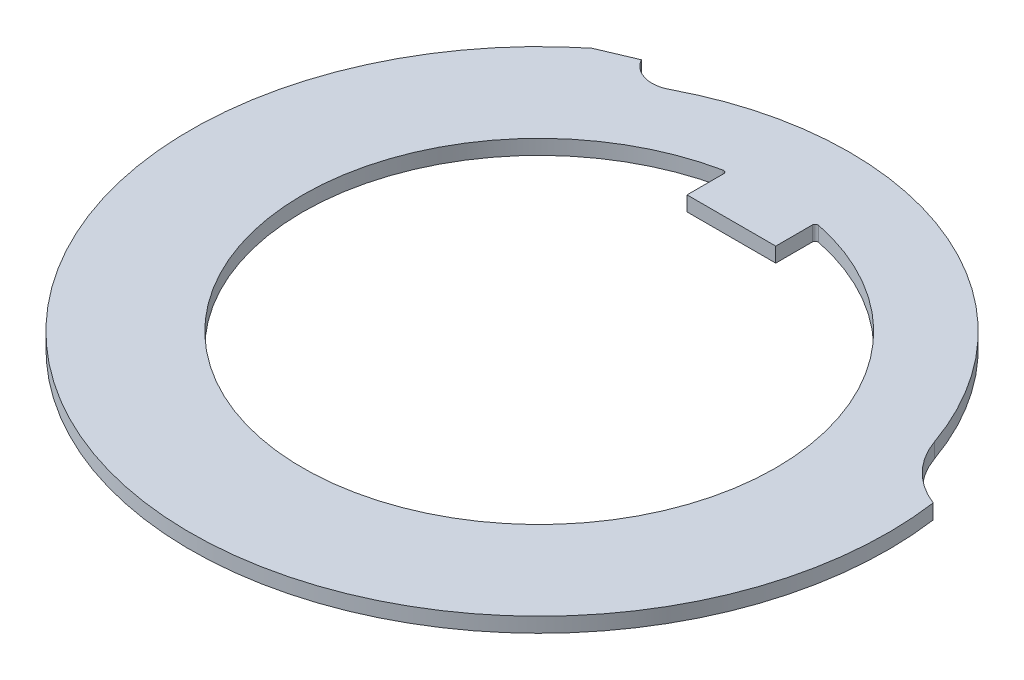
ISO-10303-21;
HEADER;
FILE_DESCRIPTION(('STEP AP214'),'2;1');
FILE_NAME('part.step','',(''),(''),'','','');
FILE_SCHEMA(('AUTOMOTIVE_DESIGN { 1 0 10303 214 1 1 1 1 }'));
ENDSEC;
DATA;
#1=APPLICATION_CONTEXT('core data for automotive mechanical design processes');
#2=APPLICATION_PROTOCOL_DEFINITION('international standard','automotive_design',2000,#1);
#3=PRODUCT_CONTEXT('',#1,'mechanical');
#4=PRODUCT('Part','Part','',(#3));
#5=PRODUCT_RELATED_PRODUCT_CATEGORY('part','',(#4));
#6=PRODUCT_DEFINITION_FORMATION('','',#4);
#7=PRODUCT_DEFINITION_CONTEXT('part definition',#1,'design');
#8=PRODUCT_DEFINITION('design','',#6,#7);
#9=PRODUCT_DEFINITION_SHAPE('','',#8);
#10=(LENGTH_UNIT() NAMED_UNIT(*) SI_UNIT(.MILLI.,.METRE.));
#11=(NAMED_UNIT(*) PLANE_ANGLE_UNIT() SI_UNIT($,.RADIAN.));
#12=(NAMED_UNIT(*) SI_UNIT($,.STERADIAN.) SOLID_ANGLE_UNIT());
#13=UNCERTAINTY_MEASURE_WITH_UNIT(LENGTH_MEASURE(1.E-05),#10,'distance_accuracy_value','');
#14=(GEOMETRIC_REPRESENTATION_CONTEXT(3) GLOBAL_UNCERTAINTY_ASSIGNED_CONTEXT((#13)) GLOBAL_UNIT_ASSIGNED_CONTEXT((#10,
#11,#12)) REPRESENTATION_CONTEXT('',''));
#15=CARTESIAN_POINT('',(0.,0.,0.));
#16=DIRECTION('',(0.,0.,1.));
#17=DIRECTION('',(1.,0.,0.));
#18=AXIS2_PLACEMENT_3D('',#15,#16,#17);
#19=CARTESIAN_POINT('',(0.,0.5,0.));
#20=DIRECTION('',(0.,1.,0.));
#21=DIRECTION('',(0.,0.,1.));
#22=AXIS2_PLACEMENT_3D('',#19,#20,#21);
#23=PLANE('',#22);
#24=CARTESIAN_POINT('',(0.,0.5,0.));
#25=DIRECTION('',(0.,1.,0.));
#26=DIRECTION('',(0.,0.,1.));
#27=AXIS2_PLACEMENT_3D('',#24,#25,#26);
#28=CIRCLE('',#27,11.8);
#29=CARTESIAN_POINT('',(-7.4058337822459,0.5,-9.18660034995239));
#30=VERTEX_POINT('',#29);
#31=CARTESIAN_POINT('',(11.6851632111505,0.5,-1.64224259132877));
#32=VERTEX_POINT('',#31);
#33=EDGE_CURVE('E168',#30,#32,#28,.T.);
#34=ORIENTED_EDGE('',*,*,#33,.T.);
#35=CARTESIAN_POINT('',(12.7460476105327,0.5,-4.44840087110333));
#36=DIRECTION('',(0.,-1.,0.));
#37=DIRECTION('',(0.,0.,-1.));
#38=AXIS2_PLACEMENT_3D('',#35,#36,#37);
#39=CIRCLE('',#38,2.99999999999996);
#40=CARTESIAN_POINT('',(9.91359258596991,0.5,-3.45986734419149));
#41=VERTEX_POINT('',#40);
#42=EDGE_CURVE('E170',#32,#41,#39,.T.);
#43=ORIENTED_EDGE('',*,*,#42,.T.);
#44=CARTESIAN_POINT('',(0.,0.5,0.));
#45=DIRECTION('',(0.,1.,0.));
#46=DIRECTION('',(0.,0.,1.));
#47=AXIS2_PLACEMENT_3D('',#44,#45,#46);
#48=CIRCLE('',#47,10.5);
#49=CARTESIAN_POINT('',(-4.89225939759349,0.5,-9.29062957967103));
#50=VERTEX_POINT('',#49);
#51=EDGE_CURVE('E173',#41,#50,#48,.T.);
#52=ORIENTED_EDGE('',*,*,#51,.T.);
#53=CARTESIAN_POINT('',(-5.35818886403097,0.5,-10.1754514444016));
#54=DIRECTION('',(0.,-1.,0.));
#55=DIRECTION('',(0.,0.,-1.));
#56=AXIS2_PLACEMENT_3D('',#53,#54,#55);
#57=CIRCLE('',#56,0.999999999999998);
#58=CARTESIAN_POINT('',(-6.23004667628437,0.5,-9.68569236565704));
#59=VERTEX_POINT('',#58);
#60=EDGE_CURVE('E175',#50,#59,#57,.T.);
#61=ORIENTED_EDGE('',*,*,#60,.T.);
#62=DIRECTION('',(-0.920504853452439,0.,0.390731128489277));
#63=VECTOR('',#62,1.);
#64=CARTESIAN_POINT('',(-7.4058337822459,0.5,-9.18660034995239));
#65=LINE('',#64,#63);
#66=EDGE_CURVE('E177',#59,#30,#65,.T.);
#67=ORIENTED_EDGE('',*,*,#66,.T.);
#68=EDGE_LOOP('',(#34,#43,#52,#61,#67));
#69=FACE_BOUND('',#68,.T.);
#70=CARTESIAN_POINT('',(0.,0.5,0.));
#71=DIRECTION('',(0.,1.,0.));
#72=DIRECTION('',(0.,0.,1.));
#73=AXIS2_PLACEMENT_3D('',#70,#71,#72);
#74=CIRCLE('',#73,8.);
#75=CARTESIAN_POINT('',(-1.62025316455696,0.5,-7.83420574677122));
#76=VERTEX_POINT('',#75);
#77=CARTESIAN_POINT('',(1.62025316455696,0.5,-7.83420574677122));
#78=VERTEX_POINT('',#77);
#79=EDGE_CURVE('E153',#76,#78,#74,.T.);
#80=ORIENTED_EDGE('',*,*,#79,.F.);
#81=CARTESIAN_POINT('',(-1.6,0.5,-7.73627817493658));
#82=DIRECTION('',(0.,1.,0.));
#83=DIRECTION('',(0.,0.,1.));
#84=AXIS2_PLACEMENT_3D('',#81,#82,#83);
#85=CIRCLE('',#84,0.1);
#86=CARTESIAN_POINT('',(-1.5,0.5,-7.73627817493658));
#87=VERTEX_POINT('',#86);
#88=EDGE_CURVE('E152',#76,#87,#85,.F.);
#89=ORIENTED_EDGE('',*,*,#88,.T.);
#90=DIRECTION('',(0.,0.,-1.));
#91=VECTOR('',#90,1.);
#92=CARTESIAN_POINT('',(-1.5,0.5,-6.5));
#93=LINE('',#92,#91);
#94=CARTESIAN_POINT('',(-1.5,0.5,-6.5));
#95=VERTEX_POINT('',#94);
#96=EDGE_CURVE('E145',#95,#87,#93,.T.);
#97=ORIENTED_EDGE('',*,*,#96,.F.);
#98=DIRECTION('',(-1.,0.,0.));
#99=VECTOR('',#98,1.);
#100=CARTESIAN_POINT('',(-1.5,0.5,-6.5));
#101=LINE('',#100,#99);
#102=CARTESIAN_POINT('',(1.5,0.5,-6.5));
#103=VERTEX_POINT('',#102);
#104=EDGE_CURVE('E129',#103,#95,#101,.T.);
#105=ORIENTED_EDGE('',*,*,#104,.F.);
#106=DIRECTION('',(0.,0.,1.));
#107=VECTOR('',#106,1.);
#108=CARTESIAN_POINT('',(1.5,0.5,-6.5));
#109=LINE('',#108,#107);
#110=CARTESIAN_POINT('',(1.5,0.5,-7.73627817493658));
#111=VERTEX_POINT('',#110);
#112=EDGE_CURVE('E139',#111,#103,#109,.T.);
#113=ORIENTED_EDGE('',*,*,#112,.F.);
#114=CARTESIAN_POINT('',(1.6,0.5,-7.73627817493658));
#115=DIRECTION('',(0.,1.,0.));
#116=DIRECTION('',(0.,0.,1.));
#117=AXIS2_PLACEMENT_3D('',#114,#115,#116);
#118=CIRCLE('',#117,0.1);
#119=EDGE_CURVE('E13',#111,#78,#118,.F.);
#120=ORIENTED_EDGE('',*,*,#119,.T.);
#121=EDGE_LOOP('',(#80,#89,#97,#105,#113,#120));
#122=FACE_BOUND('',#121,.T.);
#123=ADVANCED_FACE('F47',(#69,#122),#23,.T.);
#124=CARTESIAN_POINT('',(0.,0.,0.));
#125=DIRECTION('',(0.,1.,0.));
#126=DIRECTION('',(0.,0.,1.));
#127=AXIS2_PLACEMENT_3D('',#124,#125,#126);
#128=PLANE('',#127);
#129=CARTESIAN_POINT('',(0.,0.,0.));
#130=DIRECTION('',(0.,1.,0.));
#131=DIRECTION('',(0.,0.,1.));
#132=AXIS2_PLACEMENT_3D('',#129,#130,#131);
#133=CIRCLE('',#132,11.8);
#134=CARTESIAN_POINT('',(-7.4058337822459,0.,-9.18660034995239));
#135=VERTEX_POINT('',#134);
#136=CARTESIAN_POINT('',(11.6851632111505,0.,-1.64224259132877));
#137=VERTEX_POINT('',#136);
#138=EDGE_CURVE('E167',#135,#137,#133,.T.);
#139=ORIENTED_EDGE('',*,*,#138,.F.);
#140=DIRECTION('',(-0.920504853452439,0.,0.390731128489277));
#141=VECTOR('',#140,1.);
#142=CARTESIAN_POINT('',(-7.4058337822459,0.,-9.18660034995239));
#143=LINE('',#142,#141);
#144=CARTESIAN_POINT('',(-6.23004667628437,0.,-9.68569236565704));
#145=VERTEX_POINT('',#144);
#146=EDGE_CURVE('E171',#145,#135,#143,.T.);
#147=ORIENTED_EDGE('',*,*,#146,.F.);
#148=CARTESIAN_POINT('',(-5.35818886403097,0.,-10.1754514444016));
#149=DIRECTION('',(0.,-1.,0.));
#150=DIRECTION('',(0.,0.,-1.));
#151=AXIS2_PLACEMENT_3D('',#148,#149,#150);
#152=CIRCLE('',#151,0.999999999999998);
#153=CARTESIAN_POINT('',(-4.89225939759349,0.,-9.29062957967103));
#154=VERTEX_POINT('',#153);
#155=EDGE_CURVE('E185',#154,#145,#152,.T.);
#156=ORIENTED_EDGE('',*,*,#155,.F.);
#157=CARTESIAN_POINT('',(0.,0.,0.));
#158=DIRECTION('',(0.,1.,0.));
#159=DIRECTION('',(0.,0.,1.));
#160=AXIS2_PLACEMENT_3D('',#157,#158,#159);
#161=CIRCLE('',#160,10.5);
#162=CARTESIAN_POINT('',(9.91359258596991,0.,-3.45986734419149));
#163=VERTEX_POINT('',#162);
#164=EDGE_CURVE('E183',#163,#154,#161,.T.);
#165=ORIENTED_EDGE('',*,*,#164,.F.);
#166=CARTESIAN_POINT('',(12.7460476105327,0.,-4.44840087110333));
#167=DIRECTION('',(0.,-1.,0.));
#168=DIRECTION('',(0.,0.,-1.));
#169=AXIS2_PLACEMENT_3D('',#166,#167,#168);
#170=CIRCLE('',#169,2.99999999999996);
#171=EDGE_CURVE('E181',#137,#163,#170,.T.);
#172=ORIENTED_EDGE('',*,*,#171,.F.);
#173=EDGE_LOOP('',(#139,#147,#156,#165,#172));
#174=FACE_BOUND('',#173,.T.);
#175=DIRECTION('',(0.,0.,-1.));
#176=VECTOR('',#175,1.);
#177=CARTESIAN_POINT('',(-1.5,0.,-6.5));
#178=LINE('',#177,#176);
#179=CARTESIAN_POINT('',(-1.5,0.,-6.5));
#180=VERTEX_POINT('',#179);
#181=CARTESIAN_POINT('',(-1.5,0.,-7.73627817493658));
#182=VERTEX_POINT('',#181);
#183=EDGE_CURVE('E148',#180,#182,#178,.T.);
#184=ORIENTED_EDGE('',*,*,#183,.T.);
#185=CARTESIAN_POINT('',(-1.6,0.,-7.73627817493658));
#186=DIRECTION('',(0.,1.,0.));
#187=DIRECTION('',(0.,0.,1.));
#188=AXIS2_PLACEMENT_3D('',#185,#186,#187);
#189=CIRCLE('',#188,0.1);
#190=CARTESIAN_POINT('',(-1.62025316455696,0.,-7.83420574677122));
#191=VERTEX_POINT('',#190);
#192=EDGE_CURVE('E211',#182,#191,#189,.T.);
#193=ORIENTED_EDGE('',*,*,#192,.T.);
#194=CARTESIAN_POINT('',(0.,0.,0.));
#195=DIRECTION('',(0.,1.,0.));
#196=DIRECTION('',(0.,0.,1.));
#197=AXIS2_PLACEMENT_3D('',#194,#195,#196);
#198=CIRCLE('',#197,8.);
#199=CARTESIAN_POINT('',(1.62025316455696,0.,-7.83420574677122));
#200=VERTEX_POINT('',#199);
#201=EDGE_CURVE('E163',#191,#200,#198,.T.);
#202=ORIENTED_EDGE('',*,*,#201,.T.);
#203=CARTESIAN_POINT('',(1.6,0.,-7.73627817493658));
#204=DIRECTION('',(0.,1.,0.));
#205=DIRECTION('',(0.,0.,1.));
#206=AXIS2_PLACEMENT_3D('',#203,#204,#205);
#207=CIRCLE('',#206,0.1);
#208=CARTESIAN_POINT('',(1.5,0.,-7.73627817493658));
#209=VERTEX_POINT('',#208);
#210=EDGE_CURVE('E55',#200,#209,#207,.T.);
#211=ORIENTED_EDGE('',*,*,#210,.T.);
#212=DIRECTION('',(0.,0.,1.));
#213=VECTOR('',#212,1.);
#214=CARTESIAN_POINT('',(1.5,0.,-6.5));
#215=LINE('',#214,#213);
#216=CARTESIAN_POINT('',(1.5,0.,-6.5));
#217=VERTEX_POINT('',#216);
#218=EDGE_CURVE('E158',#209,#217,#215,.T.);
#219=ORIENTED_EDGE('',*,*,#218,.T.);
#220=DIRECTION('',(-1.,0.,0.));
#221=VECTOR('',#220,1.);
#222=CARTESIAN_POINT('',(-1.5,0.,-6.5));
#223=LINE('',#222,#221);
#224=EDGE_CURVE('E154',#217,#180,#223,.T.);
#225=ORIENTED_EDGE('',*,*,#224,.T.);
#226=EDGE_LOOP('',(#184,#193,#202,#211,#219,#225));
#227=FACE_BOUND('',#226,.T.);
#228=ADVANCED_FACE('F214',(#174,#227),#128,.F.);
#229=CARTESIAN_POINT('',(0.,0.5,0.));
#230=DIRECTION('',(0.,-1.,0.));
#231=DIRECTION('',(0.,0.,-1.));
#232=AXIS2_PLACEMENT_3D('',#229,#230,#231);
#233=CYLINDRICAL_SURFACE('',#232,11.8);
#234=ORIENTED_EDGE('',*,*,#138,.T.);
#235=DIRECTION('',(0.,-1.,0.));
#236=VECTOR('',#235,1.);
#237=CARTESIAN_POINT('',(11.6851632111505,0.5,-1.64224259132877));
#238=LINE('',#237,#236);
#239=EDGE_CURVE('E200',#32,#137,#238,.T.);
#240=ORIENTED_EDGE('',*,*,#239,.F.);
#241=ORIENTED_EDGE('',*,*,#33,.F.);
#242=DIRECTION('',(0.,-1.,0.));
#243=VECTOR('',#242,1.);
#244=CARTESIAN_POINT('',(-7.4058337822459,0.5,-9.18660034995239));
#245=LINE('',#244,#243);
#246=EDGE_CURVE('E179',#30,#135,#245,.T.);
#247=ORIENTED_EDGE('',*,*,#246,.T.);
#248=EDGE_LOOP('',(#234,#240,#241,#247));
#249=FACE_BOUND('',#248,.T.);
#250=ADVANCED_FACE('F236',(#249),#233,.T.);
#251=CARTESIAN_POINT('',(12.7460476105327,0.5,-4.44840087110333));
#252=DIRECTION('',(0.,-1.,0.));
#253=DIRECTION('',(0.,0.,-1.));
#254=AXIS2_PLACEMENT_3D('',#251,#252,#253);
#255=CYLINDRICAL_SURFACE('',#254,2.99999999999996);
#256=ORIENTED_EDGE('',*,*,#171,.T.);
#257=DIRECTION('',(0.,-1.,0.));
#258=VECTOR('',#257,1.);
#259=CARTESIAN_POINT('',(9.91359258596991,0.5,-3.45986734419149));
#260=LINE('',#259,#258);
#261=EDGE_CURVE('E197',#41,#163,#260,.T.);
#262=ORIENTED_EDGE('',*,*,#261,.F.);
#263=ORIENTED_EDGE('',*,*,#42,.F.);
#264=ORIENTED_EDGE('',*,*,#239,.T.);
#265=EDGE_LOOP('',(#256,#262,#263,#264));
#266=FACE_BOUND('',#265,.T.);
#267=ADVANCED_FACE('F253',(#266),#255,.F.);
#268=CARTESIAN_POINT('',(0.,0.5,0.));
#269=DIRECTION('',(0.,-1.,0.));
#270=DIRECTION('',(0.,0.,-1.));
#271=AXIS2_PLACEMENT_3D('',#268,#269,#270);
#272=CYLINDRICAL_SURFACE('',#271,10.5);
#273=ORIENTED_EDGE('',*,*,#164,.T.);
#274=DIRECTION('',(0.,-1.,0.));
#275=VECTOR('',#274,1.);
#276=CARTESIAN_POINT('',(-4.89225939759349,0.5,-9.29062957967103));
#277=LINE('',#276,#275);
#278=EDGE_CURVE('E194',#50,#154,#277,.T.);
#279=ORIENTED_EDGE('',*,*,#278,.F.);
#280=ORIENTED_EDGE('',*,*,#51,.F.);
#281=ORIENTED_EDGE('',*,*,#261,.T.);
#282=EDGE_LOOP('',(#273,#279,#280,#281));
#283=FACE_BOUND('',#282,.T.);
#284=ADVANCED_FACE('F249',(#283),#272,.T.);
#285=CARTESIAN_POINT('',(-5.35818886403097,0.5,-10.1754514444016));
#286=DIRECTION('',(0.,-1.,0.));
#287=DIRECTION('',(0.,0.,-1.));
#288=AXIS2_PLACEMENT_3D('',#285,#286,#287);
#289=CYLINDRICAL_SURFACE('',#288,0.999999999999998);
#290=ORIENTED_EDGE('',*,*,#155,.T.);
#291=DIRECTION('',(0.,-1.,0.));
#292=VECTOR('',#291,1.);
#293=CARTESIAN_POINT('',(-6.23004667628437,0.5,-9.68569236565704));
#294=LINE('',#293,#292);
#295=EDGE_CURVE('E191',#59,#145,#294,.T.);
#296=ORIENTED_EDGE('',*,*,#295,.F.);
#297=ORIENTED_EDGE('',*,*,#60,.F.);
#298=ORIENTED_EDGE('',*,*,#278,.T.);
#299=EDGE_LOOP('',(#290,#296,#297,#298));
#300=FACE_BOUND('',#299,.T.);
#301=ADVANCED_FACE('F245',(#300),#289,.F.);
#302=CARTESIAN_POINT('',(-7.4058337822459,0.5,-9.18660034995239));
#303=DIRECTION('',(0.390731128489277,0.,0.920504853452439));
#304=DIRECTION('',(0.920504853452439,0.,-0.390731128489277));
#305=AXIS2_PLACEMENT_3D('',#302,#303,#304);
#306=PLANE('',#305);
#307=ORIENTED_EDGE('',*,*,#146,.T.);
#308=ORIENTED_EDGE('',*,*,#246,.F.);
#309=ORIENTED_EDGE('',*,*,#66,.F.);
#310=ORIENTED_EDGE('',*,*,#295,.T.);
#311=EDGE_LOOP('',(#307,#308,#309,#310));
#312=FACE_BOUND('',#311,.T.);
#313=ADVANCED_FACE('F242',(#312),#306,.F.);
#314=CARTESIAN_POINT('',(-1.5,0.5,-6.5));
#315=DIRECTION('',(-1.,0.,0.));
#316=DIRECTION('',(0.,0.,1.));
#317=AXIS2_PLACEMENT_3D('',#314,#315,#316);
#318=PLANE('',#317);
#319=ORIENTED_EDGE('',*,*,#96,.T.);
#320=DIRECTION('',(0.,1.,0.));
#321=VECTOR('',#320,1.);
#322=CARTESIAN_POINT('',(-1.5,0.,-7.73627817493658));
#323=LINE('',#322,#321);
#324=EDGE_CURVE('E203',#87,#182,#323,.F.);
#325=ORIENTED_EDGE('',*,*,#324,.T.);
#326=ORIENTED_EDGE('',*,*,#183,.F.);
#327=DIRECTION('',(0.,-1.,0.));
#328=VECTOR('',#327,1.);
#329=CARTESIAN_POINT('',(-1.5,0.5,-6.5));
#330=LINE('',#329,#328);
#331=EDGE_CURVE('E133',#95,#180,#330,.T.);
#332=ORIENTED_EDGE('',*,*,#331,.F.);
#333=EDGE_LOOP('',(#319,#325,#326,#332));
#334=FACE_BOUND('',#333,.T.);
#335=ADVANCED_FACE('F143',(#334),#318,.T.);
#336=CARTESIAN_POINT('',(0.,0.5,0.));
#337=DIRECTION('',(0.,-1.,0.));
#338=DIRECTION('',(0.,0.,-1.));
#339=AXIS2_PLACEMENT_3D('',#336,#337,#338);
#340=CYLINDRICAL_SURFACE('',#339,8.);
#341=ORIENTED_EDGE('',*,*,#201,.F.);
#342=DIRECTION('',(0.,-1.,0.));
#343=VECTOR('',#342,1.);
#344=CARTESIAN_POINT('',(-1.62025316455696,0.5,-7.83420574677122));
#345=LINE('',#344,#343);
#346=EDGE_CURVE('E208',#191,#76,#345,.F.);
#347=ORIENTED_EDGE('',*,*,#346,.T.);
#348=ORIENTED_EDGE('',*,*,#79,.T.);
#349=DIRECTION('',(0.,-1.,0.));
#350=VECTOR('',#349,1.);
#351=CARTESIAN_POINT('',(1.62025316455696,0.5,-7.83420574677122));
#352=LINE('',#351,#350);
#353=EDGE_CURVE('E205',#78,#200,#352,.T.);
#354=ORIENTED_EDGE('',*,*,#353,.T.);
#355=EDGE_LOOP('',(#341,#347,#348,#354));
#356=FACE_BOUND('',#355,.T.);
#357=ADVANCED_FACE('F218',(#356),#340,.F.);
#358=CARTESIAN_POINT('',(1.5,0.5,-6.5));
#359=DIRECTION('',(1.,0.,0.));
#360=DIRECTION('',(0.,0.,-1.));
#361=AXIS2_PLACEMENT_3D('',#358,#359,#360);
#362=PLANE('',#361);
#363=ORIENTED_EDGE('',*,*,#218,.F.);
#364=DIRECTION('',(0.,1.,0.));
#365=VECTOR('',#364,1.);
#366=CARTESIAN_POINT('',(1.5,0.5,-7.73627817493658));
#367=LINE('',#366,#365);
#368=EDGE_CURVE('E62',#209,#111,#367,.T.);
#369=ORIENTED_EDGE('',*,*,#368,.T.);
#370=ORIENTED_EDGE('',*,*,#112,.T.);
#371=DIRECTION('',(0.,-1.,0.));
#372=VECTOR('',#371,1.);
#373=CARTESIAN_POINT('',(1.5,0.5,-6.5));
#374=LINE('',#373,#372);
#375=EDGE_CURVE('E136',#103,#217,#374,.T.);
#376=ORIENTED_EDGE('',*,*,#375,.T.);
#377=EDGE_LOOP('',(#363,#369,#370,#376));
#378=FACE_BOUND('',#377,.T.);
#379=ADVANCED_FACE('F227',(#378),#362,.T.);
#380=CARTESIAN_POINT('',(-1.5,0.5,-6.5));
#381=DIRECTION('',(0.,0.,1.));
#382=DIRECTION('',(1.,0.,0.));
#383=AXIS2_PLACEMENT_3D('',#380,#381,#382);
#384=PLANE('',#383);
#385=ORIENTED_EDGE('',*,*,#224,.F.);
#386=ORIENTED_EDGE('',*,*,#375,.F.);
#387=ORIENTED_EDGE('',*,*,#104,.T.);
#388=ORIENTED_EDGE('',*,*,#331,.T.);
#389=EDGE_LOOP('',(#385,#386,#387,#388));
#390=FACE_BOUND('',#389,.T.);
#391=ADVANCED_FACE('F132',(#390),#384,.T.);
#392=CARTESIAN_POINT('',(-1.6,0.5,-7.73627817493658));
#393=DIRECTION('',(0.,-1.,0.));
#394=DIRECTION('',(0.,0.,-1.));
#395=AXIS2_PLACEMENT_3D('',#392,#393,#394);
#396=CYLINDRICAL_SURFACE('',#395,0.1);
#397=ORIENTED_EDGE('',*,*,#88,.F.);
#398=ORIENTED_EDGE('',*,*,#346,.F.);
#399=ORIENTED_EDGE('',*,*,#192,.F.);
#400=ORIENTED_EDGE('',*,*,#324,.F.);
#401=EDGE_LOOP('',(#397,#398,#399,#400));
#402=FACE_BOUND('',#401,.T.);
#403=ADVANCED_FACE('F220',(#402),#396,.F.);
#404=CARTESIAN_POINT('',(1.6,0.5,-7.73627817493658));
#405=DIRECTION('',(0.,-1.,0.));
#406=DIRECTION('',(0.,0.,-1.));
#407=AXIS2_PLACEMENT_3D('',#404,#405,#406);
#408=CYLINDRICAL_SURFACE('',#407,0.1);
#409=ORIENTED_EDGE('',*,*,#119,.F.);
#410=ORIENTED_EDGE('',*,*,#368,.F.);
#411=ORIENTED_EDGE('',*,*,#210,.F.);
#412=ORIENTED_EDGE('',*,*,#353,.F.);
#413=EDGE_LOOP('',(#409,#410,#411,#412));
#414=FACE_BOUND('',#413,.T.);
#415=ADVANCED_FACE('F49',(#414),#408,.F.);
#416=CLOSED_SHELL('',(#123,#228,#250,#267,#284,#301,#313,#335,#357,#379,#391,#403,#415));
#417=MANIFOLD_SOLID_BREP('B2',#416);
#418=ADVANCED_BREP_SHAPE_REPRESENTATION('',(#18,#417),#14);
#419=SHAPE_DEFINITION_REPRESENTATION(#9,#418);
ENDSEC;
END-ISO-10303-21;
